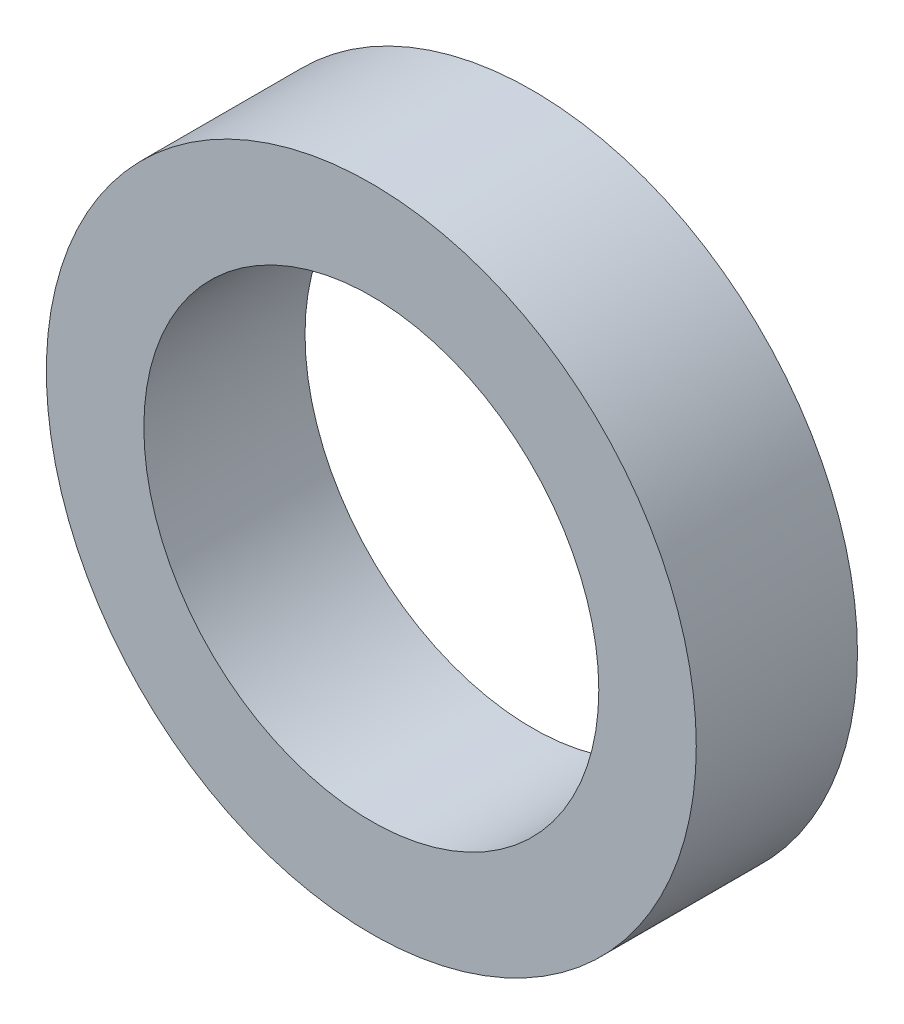
ISO-10303-21;
HEADER;
FILE_DESCRIPTION(('STEP AP214'),'2;1');
FILE_NAME('part.step','',(''),(''),'','','');
FILE_SCHEMA(('AUTOMOTIVE_DESIGN { 1 0 10303 214 1 1 1 1 }'));
ENDSEC;
DATA;
#1=APPLICATION_CONTEXT('core data for automotive mechanical design processes');
#2=APPLICATION_PROTOCOL_DEFINITION('international standard','automotive_design',2000,#1);
#3=PRODUCT_CONTEXT('',#1,'mechanical');
#4=PRODUCT('Part','Part','',(#3));
#5=PRODUCT_RELATED_PRODUCT_CATEGORY('part','',(#4));
#6=PRODUCT_DEFINITION_FORMATION('','',#4);
#7=PRODUCT_DEFINITION_CONTEXT('part definition',#1,'design');
#8=PRODUCT_DEFINITION('design','',#6,#7);
#9=PRODUCT_DEFINITION_SHAPE('','',#8);
#10=(LENGTH_UNIT() NAMED_UNIT(*) SI_UNIT(.MILLI.,.METRE.));
#11=(NAMED_UNIT(*) PLANE_ANGLE_UNIT() SI_UNIT($,.RADIAN.));
#12=(NAMED_UNIT(*) SI_UNIT($,.STERADIAN.) SOLID_ANGLE_UNIT());
#13=UNCERTAINTY_MEASURE_WITH_UNIT(LENGTH_MEASURE(1.E-05),#10,'distance_accuracy_value','');
#14=(GEOMETRIC_REPRESENTATION_CONTEXT(3) GLOBAL_UNCERTAINTY_ASSIGNED_CONTEXT((#13)) GLOBAL_UNIT_ASSIGNED_CONTEXT((#10,
#11,#12)) REPRESENTATION_CONTEXT('',''));
#15=CARTESIAN_POINT('',(0.,0.,0.));
#16=DIRECTION('',(0.,0.,1.));
#17=DIRECTION('',(1.,0.,0.));
#18=AXIS2_PLACEMENT_3D('',#15,#16,#17);
#19=CARTESIAN_POINT('',(0.,0.,3.937));
#20=DIRECTION('',(0.,0.,1.));
#21=DIRECTION('',(1.,0.,0.));
#22=AXIS2_PLACEMENT_3D('',#19,#20,#21);
#23=PLANE('',#22);
#24=CARTESIAN_POINT('',(0.,0.,3.937));
#25=DIRECTION('',(0.,0.,1.));
#26=DIRECTION('',(1.,0.,0.));
#27=AXIS2_PLACEMENT_3D('',#24,#25,#26);
#28=CIRCLE('',#27,15.875);
#29=CARTESIAN_POINT('',(15.875,0.,3.937));
#30=VERTEX_POINT('',#29);
#31=EDGE_CURVE('E10',#30,#30,#28,.T.);
#32=ORIENTED_EDGE('',*,*,#31,.T.);
#33=EDGE_LOOP('',(#32));
#34=FACE_BOUND('',#33,.T.);
#35=CARTESIAN_POINT('',(0.,0.,3.937));
#36=DIRECTION('',(0.,0.,1.));
#37=DIRECTION('',(1.,0.,0.));
#38=AXIS2_PLACEMENT_3D('',#35,#36,#37);
#39=CIRCLE('',#38,11.1125);
#40=CARTESIAN_POINT('',(11.1125,0.,3.937));
#41=VERTEX_POINT('',#40);
#42=EDGE_CURVE('E42',#41,#41,#39,.T.);
#43=ORIENTED_EDGE('',*,*,#42,.F.);
#44=EDGE_LOOP('',(#43));
#45=FACE_BOUND('',#44,.T.);
#46=ADVANCED_FACE('F31',(#34,#45),#23,.T.);
#47=CARTESIAN_POINT('',(0.,0.,-3.937));
#48=DIRECTION('',(0.,0.,1.));
#49=DIRECTION('',(1.,0.,0.));
#50=AXIS2_PLACEMENT_3D('',#47,#48,#49);
#51=PLANE('',#50);
#52=CARTESIAN_POINT('',(0.,0.,-3.937));
#53=DIRECTION('',(0.,0.,1.));
#54=DIRECTION('',(1.,0.,0.));
#55=AXIS2_PLACEMENT_3D('',#52,#53,#54);
#56=CIRCLE('',#55,15.875);
#57=CARTESIAN_POINT('',(15.875,0.,-3.937));
#58=VERTEX_POINT('',#57);
#59=EDGE_CURVE('E35',#58,#58,#56,.T.);
#60=ORIENTED_EDGE('',*,*,#59,.F.);
#61=EDGE_LOOP('',(#60));
#62=FACE_BOUND('',#61,.T.);
#63=CARTESIAN_POINT('',(0.,0.,-3.937));
#64=DIRECTION('',(0.,0.,1.));
#65=DIRECTION('',(1.,0.,0.));
#66=AXIS2_PLACEMENT_3D('',#63,#64,#65);
#67=CIRCLE('',#66,11.1125);
#68=CARTESIAN_POINT('',(11.1125,0.,-3.937));
#69=VERTEX_POINT('',#68);
#70=EDGE_CURVE('E44',#69,#69,#67,.T.);
#71=ORIENTED_EDGE('',*,*,#70,.T.);
#72=EDGE_LOOP('',(#71));
#73=FACE_BOUND('',#72,.T.);
#74=ADVANCED_FACE('F54',(#62,#73),#51,.F.);
#75=CARTESIAN_POINT('',(0.,0.,3.937));
#76=DIRECTION('',(0.,0.,-1.));
#77=DIRECTION('',(-1.,0.,0.));
#78=AXIS2_PLACEMENT_3D('',#75,#76,#77);
#79=CYLINDRICAL_SURFACE('',#78,15.875);
#80=ORIENTED_EDGE('',*,*,#31,.F.);
#81=EDGE_LOOP('',(#80));
#82=FACE_BOUND('',#81,.T.);
#83=ORIENTED_EDGE('',*,*,#59,.T.);
#84=EDGE_LOOP('',(#83));
#85=FACE_BOUND('',#84,.T.);
#86=ADVANCED_FACE('F33',(#82,#85),#79,.T.);
#87=CARTESIAN_POINT('',(0.,0.,3.937));
#88=DIRECTION('',(0.,0.,-1.));
#89=DIRECTION('',(-1.,0.,0.));
#90=AXIS2_PLACEMENT_3D('',#87,#88,#89);
#91=CYLINDRICAL_SURFACE('',#90,11.1125);
#92=ORIENTED_EDGE('',*,*,#42,.T.);
#93=EDGE_LOOP('',(#92));
#94=FACE_BOUND('',#93,.T.);
#95=ORIENTED_EDGE('',*,*,#70,.F.);
#96=EDGE_LOOP('',(#95));
#97=FACE_BOUND('',#96,.T.);
#98=ADVANCED_FACE('F50',(#94,#97),#91,.F.);
#99=CLOSED_SHELL('',(#46,#74,#86,#98));
#100=MANIFOLD_SOLID_BREP('B2',#99);
#101=ADVANCED_BREP_SHAPE_REPRESENTATION('',(#18,#100),#14);
#102=SHAPE_DEFINITION_REPRESENTATION(#9,#101);
ENDSEC;
END-ISO-10303-21;
